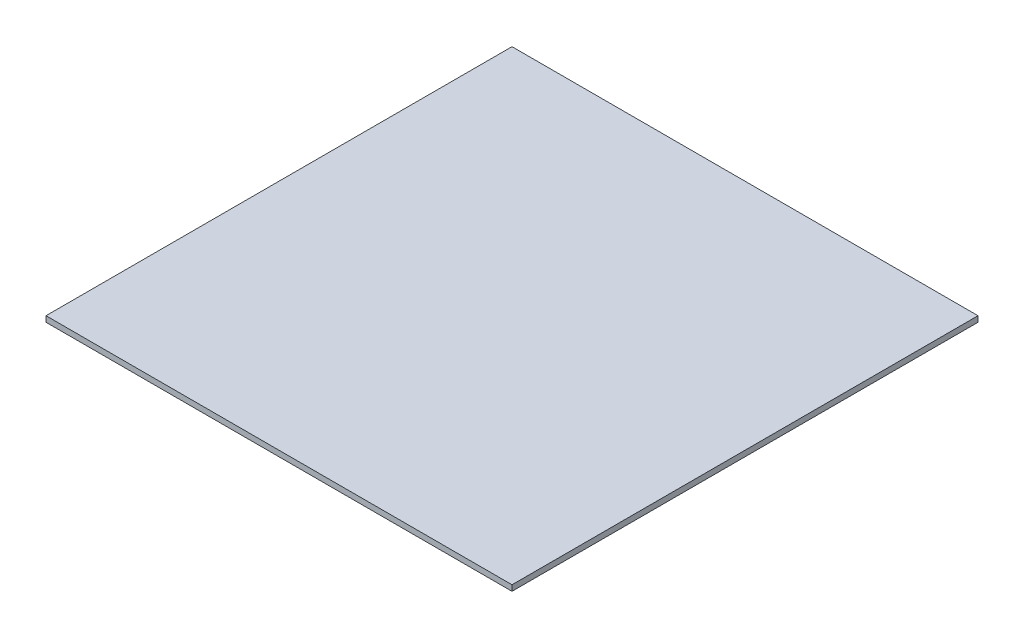
ISO-10303-21;
HEADER;
FILE_DESCRIPTION(('STEP AP214'),'2;1');
FILE_NAME('part.step','',(''),(''),'','','');
FILE_SCHEMA(('AUTOMOTIVE_DESIGN { 1 0 10303 214 1 1 1 1 }'));
ENDSEC;
DATA;
#1=APPLICATION_CONTEXT('core data for automotive mechanical design processes');
#2=APPLICATION_PROTOCOL_DEFINITION('international standard','automotive_design',2000,#1);
#3=PRODUCT_CONTEXT('',#1,'mechanical');
#4=PRODUCT('Part','Part','',(#3));
#5=PRODUCT_RELATED_PRODUCT_CATEGORY('part','',(#4));
#6=PRODUCT_DEFINITION_FORMATION('','',#4);
#7=PRODUCT_DEFINITION_CONTEXT('part definition',#1,'design');
#8=PRODUCT_DEFINITION('design','',#6,#7);
#9=PRODUCT_DEFINITION_SHAPE('','',#8);
#10=(LENGTH_UNIT() NAMED_UNIT(*) SI_UNIT(.MILLI.,.METRE.));
#11=(NAMED_UNIT(*) PLANE_ANGLE_UNIT() SI_UNIT($,.RADIAN.));
#12=(NAMED_UNIT(*) SI_UNIT($,.STERADIAN.) SOLID_ANGLE_UNIT());
#13=UNCERTAINTY_MEASURE_WITH_UNIT(LENGTH_MEASURE(1.E-05),#10,'distance_accuracy_value','');
#14=(GEOMETRIC_REPRESENTATION_CONTEXT(3) GLOBAL_UNCERTAINTY_ASSIGNED_CONTEXT((#13)) GLOBAL_UNIT_ASSIGNED_CONTEXT((#10,
#11,#12)) REPRESENTATION_CONTEXT('',''));
#15=CARTESIAN_POINT('',(0.,0.,0.));
#16=DIRECTION('',(0.,0.,1.));
#17=DIRECTION('',(1.,0.,0.));
#18=AXIS2_PLACEMENT_3D('',#15,#16,#17);
#19=CARTESIAN_POINT('',(102.,-2.9,-102.));
#20=DIRECTION('',(-1.,0.,0.));
#21=DIRECTION('',(0.,0.,1.));
#22=AXIS2_PLACEMENT_3D('',#19,#20,#21);
#23=PLANE('',#22);
#24=DIRECTION('',(0.,0.,-1.));
#25=VECTOR('',#24,1.);
#26=CARTESIAN_POINT('',(102.,-5.4,-102.));
#27=LINE('',#26,#25);
#28=CARTESIAN_POINT('',(102.,-5.4,102.));
#29=VERTEX_POINT('',#28);
#30=CARTESIAN_POINT('',(102.,-5.4,-102.));
#31=VERTEX_POINT('',#30);
#32=EDGE_CURVE('E96',#29,#31,#27,.T.);
#33=ORIENTED_EDGE('',*,*,#32,.T.);
#34=DIRECTION('',(0.,-1.,0.));
#35=VECTOR('',#34,1.);
#36=CARTESIAN_POINT('',(102.,-2.9,-102.));
#37=LINE('',#36,#35);
#38=CARTESIAN_POINT('',(102.,-2.9,-102.));
#39=VERTEX_POINT('',#38);
#40=EDGE_CURVE('E11',#39,#31,#37,.T.);
#41=ORIENTED_EDGE('',*,*,#40,.F.);
#42=DIRECTION('',(0.,0.,-1.));
#43=VECTOR('',#42,1.);
#44=CARTESIAN_POINT('',(102.,-2.9,-102.));
#45=LINE('',#44,#43);
#46=CARTESIAN_POINT('',(102.,-2.9,102.));
#47=VERTEX_POINT('',#46);
#48=EDGE_CURVE('E84',#47,#39,#45,.T.);
#49=ORIENTED_EDGE('',*,*,#48,.F.);
#50=DIRECTION('',(0.,-1.,0.));
#51=VECTOR('',#50,1.);
#52=CARTESIAN_POINT('',(102.,-2.9,102.));
#53=LINE('',#52,#51);
#54=EDGE_CURVE('E92',#47,#29,#53,.T.);
#55=ORIENTED_EDGE('',*,*,#54,.T.);
#56=EDGE_LOOP('',(#33,#41,#49,#55));
#57=FACE_BOUND('',#56,.T.);
#58=ADVANCED_FACE('F33',(#57),#23,.F.);
#59=CARTESIAN_POINT('',(102.,-2.9,-102.));
#60=DIRECTION('',(0.,0.,1.));
#61=DIRECTION('',(1.,0.,0.));
#62=AXIS2_PLACEMENT_3D('',#59,#60,#61);
#63=PLANE('',#62);
#64=DIRECTION('',(-1.,0.,0.));
#65=VECTOR('',#64,1.);
#66=CARTESIAN_POINT('',(102.,-5.4,-102.));
#67=LINE('',#66,#65);
#68=CARTESIAN_POINT('',(-102.,-5.4,-102.));
#69=VERTEX_POINT('',#68);
#70=EDGE_CURVE('E88',#31,#69,#67,.T.);
#71=ORIENTED_EDGE('',*,*,#70,.T.);
#72=DIRECTION('',(0.,-1.,0.));
#73=VECTOR('',#72,1.);
#74=CARTESIAN_POINT('',(-102.,-2.9,-102.));
#75=LINE('',#74,#73);
#76=CARTESIAN_POINT('',(-102.,-2.9,-102.));
#77=VERTEX_POINT('',#76);
#78=EDGE_CURVE('E41',#77,#69,#75,.T.);
#79=ORIENTED_EDGE('',*,*,#78,.F.);
#80=DIRECTION('',(-1.,0.,0.));
#81=VECTOR('',#80,1.);
#82=CARTESIAN_POINT('',(102.,-2.9,-102.));
#83=LINE('',#82,#81);
#84=EDGE_CURVE('E79',#39,#77,#83,.T.);
#85=ORIENTED_EDGE('',*,*,#84,.F.);
#86=ORIENTED_EDGE('',*,*,#40,.T.);
#87=EDGE_LOOP('',(#71,#79,#85,#86));
#88=FACE_BOUND('',#87,.T.);
#89=ADVANCED_FACE('F87',(#88),#63,.F.);
#90=CARTESIAN_POINT('',(-102.,-2.9,-102.));
#91=DIRECTION('',(1.,0.,0.));
#92=DIRECTION('',(0.,0.,-1.));
#93=AXIS2_PLACEMENT_3D('',#90,#91,#92);
#94=PLANE('',#93);
#95=DIRECTION('',(0.,0.,1.));
#96=VECTOR('',#95,1.);
#97=CARTESIAN_POINT('',(-102.,-5.4,-102.));
#98=LINE('',#97,#96);
#99=CARTESIAN_POINT('',(-102.,-5.4,102.));
#100=VERTEX_POINT('',#99);
#101=EDGE_CURVE('E66',#69,#100,#98,.T.);
#102=ORIENTED_EDGE('',*,*,#101,.T.);
#103=DIRECTION('',(0.,-1.,0.));
#104=VECTOR('',#103,1.);
#105=CARTESIAN_POINT('',(-102.,-2.9,102.));
#106=LINE('',#105,#104);
#107=CARTESIAN_POINT('',(-102.,-2.9,102.));
#108=VERTEX_POINT('',#107);
#109=EDGE_CURVE('E89',#108,#100,#106,.T.);
#110=ORIENTED_EDGE('',*,*,#109,.F.);
#111=DIRECTION('',(0.,0.,1.));
#112=VECTOR('',#111,1.);
#113=CARTESIAN_POINT('',(-102.,-2.9,-102.));
#114=LINE('',#113,#112);
#115=EDGE_CURVE('E82',#77,#108,#114,.T.);
#116=ORIENTED_EDGE('',*,*,#115,.F.);
#117=ORIENTED_EDGE('',*,*,#78,.T.);
#118=EDGE_LOOP('',(#102,#110,#116,#117));
#119=FACE_BOUND('',#118,.T.);
#120=ADVANCED_FACE('F90',(#119),#94,.F.);
#121=CARTESIAN_POINT('',(102.,-2.9,102.));
#122=DIRECTION('',(0.,0.,-1.));
#123=DIRECTION('',(-1.,0.,0.));
#124=AXIS2_PLACEMENT_3D('',#121,#122,#123);
#125=PLANE('',#124);
#126=DIRECTION('',(1.,0.,0.));
#127=VECTOR('',#126,1.);
#128=CARTESIAN_POINT('',(102.,-5.4,102.));
#129=LINE('',#128,#127);
#130=EDGE_CURVE('E72',#100,#29,#129,.T.);
#131=ORIENTED_EDGE('',*,*,#130,.T.);
#132=ORIENTED_EDGE('',*,*,#54,.F.);
#133=DIRECTION('',(1.,0.,0.));
#134=VECTOR('',#133,1.);
#135=CARTESIAN_POINT('',(102.,-2.9,102.));
#136=LINE('',#135,#134);
#137=EDGE_CURVE('E49',#108,#47,#136,.T.);
#138=ORIENTED_EDGE('',*,*,#137,.F.);
#139=ORIENTED_EDGE('',*,*,#109,.T.);
#140=EDGE_LOOP('',(#131,#132,#138,#139));
#141=FACE_BOUND('',#140,.T.);
#142=ADVANCED_FACE('F103',(#141),#125,.F.);
#143=CARTESIAN_POINT('',(0.,-2.9,0.));
#144=DIRECTION('',(0.,-1.,0.));
#145=DIRECTION('',(0.,0.,-1.));
#146=AXIS2_PLACEMENT_3D('',#143,#144,#145);
#147=PLANE('',#146);
#148=ORIENTED_EDGE('',*,*,#48,.T.);
#149=ORIENTED_EDGE('',*,*,#84,.T.);
#150=ORIENTED_EDGE('',*,*,#115,.T.);
#151=ORIENTED_EDGE('',*,*,#137,.T.);
#152=EDGE_LOOP('',(#148,#149,#150,#151));
#153=FACE_BOUND('',#152,.T.);
#154=ADVANCED_FACE('F80',(#153),#147,.F.);
#155=CARTESIAN_POINT('',(0.,-5.4,0.));
#156=DIRECTION('',(0.,-1.,0.));
#157=DIRECTION('',(0.,0.,-1.));
#158=AXIS2_PLACEMENT_3D('',#155,#156,#157);
#159=PLANE('',#158);
#160=ORIENTED_EDGE('',*,*,#32,.F.);
#161=ORIENTED_EDGE('',*,*,#130,.F.);
#162=ORIENTED_EDGE('',*,*,#101,.F.);
#163=ORIENTED_EDGE('',*,*,#70,.F.);
#164=EDGE_LOOP('',(#160,#161,#162,#163));
#165=FACE_BOUND('',#164,.T.);
#166=ADVANCED_FACE('F106',(#165),#159,.T.);
#167=CLOSED_SHELL('',(#58,#89,#120,#142,#154,#166));
#168=MANIFOLD_SOLID_BREP('B2',#167);
#169=ADVANCED_BREP_SHAPE_REPRESENTATION('',(#18,#168),#14);
#170=SHAPE_DEFINITION_REPRESENTATION(#9,#169);
ENDSEC;
END-ISO-10303-21;
